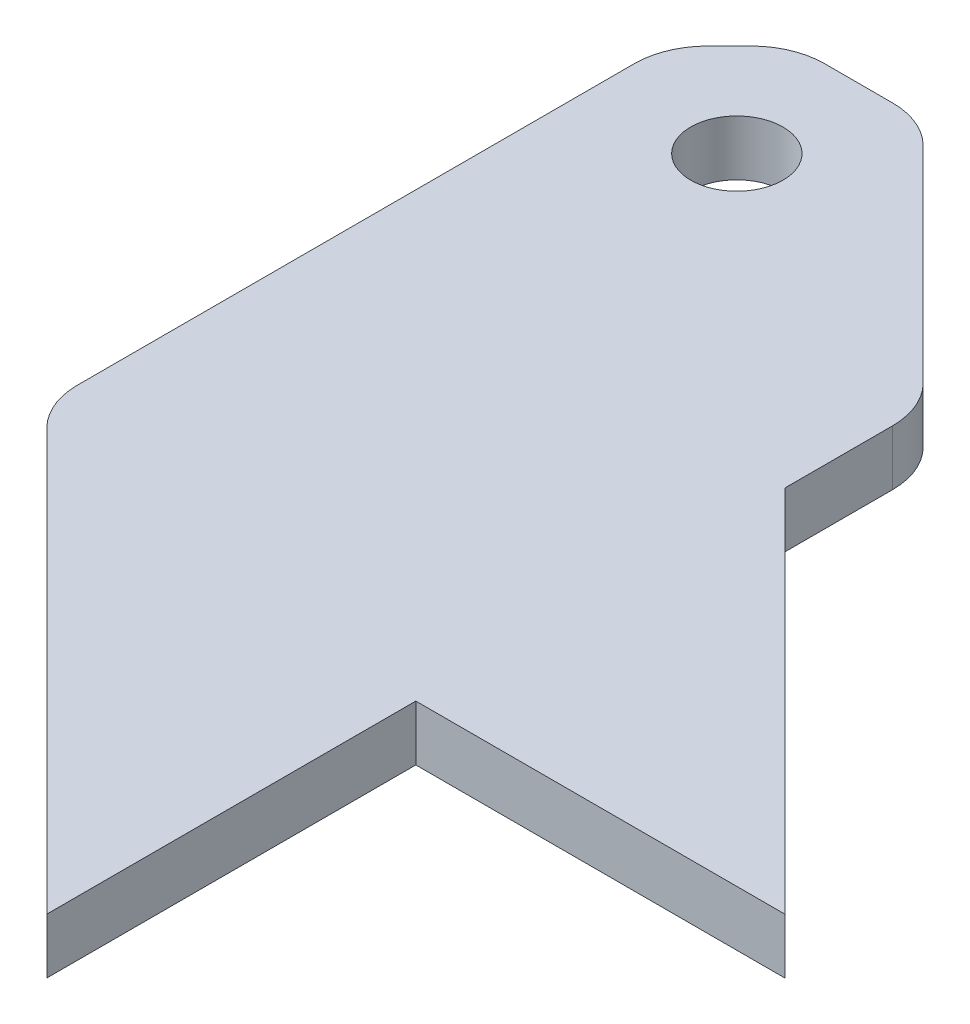
ISO-10303-21;
HEADER;
FILE_DESCRIPTION(('STEP AP214'),'2;1');
FILE_NAME('part.step','',(''),(''),'','','');
FILE_SCHEMA(('AUTOMOTIVE_DESIGN { 1 0 10303 214 1 1 1 1 }'));
ENDSEC;
DATA;
#1=APPLICATION_CONTEXT('core data for automotive mechanical design processes');
#2=APPLICATION_PROTOCOL_DEFINITION('international standard','automotive_design',2000,#1);
#3=PRODUCT_CONTEXT('',#1,'mechanical');
#4=PRODUCT('Part','Part','',(#3));
#5=PRODUCT_RELATED_PRODUCT_CATEGORY('part','',(#4));
#6=PRODUCT_DEFINITION_FORMATION('','',#4);
#7=PRODUCT_DEFINITION_CONTEXT('part definition',#1,'design');
#8=PRODUCT_DEFINITION('design','',#6,#7);
#9=PRODUCT_DEFINITION_SHAPE('','',#8);
#10=(LENGTH_UNIT() NAMED_UNIT(*) SI_UNIT(.MILLI.,.METRE.));
#11=(NAMED_UNIT(*) PLANE_ANGLE_UNIT() SI_UNIT($,.RADIAN.));
#12=(NAMED_UNIT(*) SI_UNIT($,.STERADIAN.) SOLID_ANGLE_UNIT());
#13=UNCERTAINTY_MEASURE_WITH_UNIT(LENGTH_MEASURE(1.E-05),#10,'distance_accuracy_value','');
#14=(GEOMETRIC_REPRESENTATION_CONTEXT(3) GLOBAL_UNCERTAINTY_ASSIGNED_CONTEXT((#13)) GLOBAL_UNIT_ASSIGNED_CONTEXT((#10,
#11,#12)) REPRESENTATION_CONTEXT('',''));
#15=CARTESIAN_POINT('',(0.,0.,0.));
#16=DIRECTION('',(0.,0.,1.));
#17=DIRECTION('',(1.,0.,0.));
#18=AXIS2_PLACEMENT_3D('',#15,#16,#17);
#19=CARTESIAN_POINT('',(-550.,591.,-59.9999999999939));
#20=DIRECTION('',(0.,0.,1.));
#21=DIRECTION('',(-1.,0.,0.));
#22=AXIS2_PLACEMENT_3D('',#19,#20,#21);
#23=PLANE('',#22);
#24=DIRECTION('',(0.,1.,0.));
#25=VECTOR('',#24,1.);
#26=CARTESIAN_POINT('',(-650.,591.,-59.9999999999928));
#27=LINE('',#26,#25);
#28=CARTESIAN_POINT('',(-650.,576.,-59.9999999999928));
#29=VERTEX_POINT('',#28);
#30=CARTESIAN_POINT('',(-650.,591.,-59.9999999999928));
#31=VERTEX_POINT('',#30);
#32=EDGE_CURVE('E11',#29,#31,#27,.T.);
#33=ORIENTED_EDGE('',*,*,#32,.F.);
#34=DIRECTION('',(-1.,0.,0.));
#35=VECTOR('',#34,1.);
#36=CARTESIAN_POINT('',(-649.999999999998,576.,-59.999999999995));
#37=LINE('',#36,#35);
#38=CARTESIAN_POINT('',(-550.,576.,-59.9999999999939));
#39=VERTEX_POINT('',#38);
#40=EDGE_CURVE('E122',#39,#29,#37,.T.);
#41=ORIENTED_EDGE('',*,*,#40,.F.);
#42=DIRECTION('',(0.,1.,0.));
#43=VECTOR('',#42,1.);
#44=CARTESIAN_POINT('',(-550.,591.,-59.9999999999939));
#45=LINE('',#44,#43);
#46=CARTESIAN_POINT('',(-550.,591.,-59.9999999999939));
#47=VERTEX_POINT('',#46);
#48=EDGE_CURVE('E46',#39,#47,#45,.T.);
#49=ORIENTED_EDGE('',*,*,#48,.T.);
#50=DIRECTION('',(-1.,0.,0.));
#51=VECTOR('',#50,1.);
#52=CARTESIAN_POINT('',(-550.,591.,-59.9999999999939));
#53=LINE('',#52,#51);
#54=EDGE_CURVE('E198',#47,#31,#53,.T.);
#55=ORIENTED_EDGE('',*,*,#54,.T.);
#56=EDGE_LOOP('',(#33,#41,#49,#55));
#57=FACE_BOUND('',#56,.T.);
#58=ADVANCED_FACE('F37',(#57),#23,.T.);
#59=CARTESIAN_POINT('',(-649.999999999999,591.,-159.999999999992));
#60=DIRECTION('',(-0.707106781186549,0.,0.707106781186546));
#61=DIRECTION('',(-0.707106781186537,0.,-0.70710678118654));
#62=AXIS2_PLACEMENT_3D('',#59,#60,#61);
#63=PLANE('',#62);
#64=ORIENTED_EDGE('',*,*,#48,.F.);
#65=DIRECTION('',(-0.707106781186537,0.,-0.70710678118654));
#66=VECTOR('',#65,1.);
#67=CARTESIAN_POINT('',(-649.999999999999,576.,-159.999999999992));
#68=LINE('',#67,#66);
#69=CARTESIAN_POINT('',(-650.,576.,-159.999999999993));
#70=VERTEX_POINT('',#69);
#71=EDGE_CURVE('E161',#70,#39,#68,.F.);
#72=ORIENTED_EDGE('',*,*,#71,.F.);
#73=DIRECTION('',(0.,1.,0.));
#74=VECTOR('',#73,1.);
#75=CARTESIAN_POINT('',(-650.,591.,-159.999999999993));
#76=LINE('',#75,#74);
#77=CARTESIAN_POINT('',(-650.,591.,-159.999999999993));
#78=VERTEX_POINT('',#77);
#79=EDGE_CURVE('E191',#70,#78,#76,.T.);
#80=ORIENTED_EDGE('',*,*,#79,.T.);
#81=DIRECTION('',(-0.707106781186537,0.,-0.70710678118654));
#82=VECTOR('',#81,1.);
#83=CARTESIAN_POINT('',(-649.999999999999,591.,-159.999999999992));
#84=LINE('',#83,#82);
#85=EDGE_CURVE('E208',#78,#47,#84,.F.);
#86=ORIENTED_EDGE('',*,*,#85,.T.);
#87=EDGE_LOOP('',(#64,#72,#80,#86));
#88=FACE_BOUND('',#87,.T.);
#89=ADVANCED_FACE('F211',(#88),#63,.F.);
#90=CARTESIAN_POINT('',(-649.999999999995,591.,-264.999999999993));
#91=DIRECTION('',(1.,0.,0.));
#92=DIRECTION('',(0.,0.,1.));
#93=AXIS2_PLACEMENT_3D('',#90,#91,#92);
#94=PLANE('',#93);
#95=ORIENTED_EDGE('',*,*,#79,.F.);
#96=DIRECTION('',(0.,0.,1.));
#97=VECTOR('',#96,1.);
#98=CARTESIAN_POINT('',(-649.999999999999,576.,-264.999999999993));
#99=LINE('',#98,#97);
#100=CARTESIAN_POINT('',(-650.,576.,-189.215728752532));
#101=VERTEX_POINT('',#100);
#102=EDGE_CURVE('E158',#101,#70,#99,.T.);
#103=ORIENTED_EDGE('',*,*,#102,.F.);
#104=DIRECTION('',(0.,1.,0.));
#105=VECTOR('',#104,1.);
#106=CARTESIAN_POINT('',(-650.,591.,-189.215728752532));
#107=LINE('',#106,#105);
#108=CARTESIAN_POINT('',(-650.,591.,-189.215728752532));
#109=VERTEX_POINT('',#108);
#110=EDGE_CURVE('E188',#101,#109,#107,.T.);
#111=ORIENTED_EDGE('',*,*,#110,.T.);
#112=DIRECTION('',(0.,0.,1.));
#113=VECTOR('',#112,1.);
#114=CARTESIAN_POINT('',(-649.999999999995,591.,-264.999999999993));
#115=LINE('',#114,#113);
#116=EDGE_CURVE('E212',#109,#78,#115,.T.);
#117=ORIENTED_EDGE('',*,*,#116,.T.);
#118=EDGE_LOOP('',(#95,#103,#111,#117));
#119=FACE_BOUND('',#118,.T.);
#120=ADVANCED_FACE('F268',(#119),#94,.T.);
#121=CARTESIAN_POINT('',(-670.,591.,-189.21572875253));
#122=DIRECTION('',(0.,-1.,0.));
#123=DIRECTION('',(0.,0.,-1.));
#124=AXIS2_PLACEMENT_3D('',#121,#122,#123);
#125=CYLINDRICAL_SURFACE('',#124,20.);
#126=ORIENTED_EDGE('',*,*,#110,.F.);
#127=CARTESIAN_POINT('',(-670.,576.,-189.21572875253));
#128=DIRECTION('',(0.,1.,0.));
#129=DIRECTION('',(0.,0.,1.));
#130=AXIS2_PLACEMENT_3D('',#127,#128,#129);
#131=CIRCLE('',#130,20.);
#132=CARTESIAN_POINT('',(-655.857864376265,576.,-203.357864376261));
#133=VERTEX_POINT('',#132);
#134=EDGE_CURVE('E155',#133,#101,#131,.F.);
#135=ORIENTED_EDGE('',*,*,#134,.F.);
#136=DIRECTION('',(0.,1.,0.));
#137=VECTOR('',#136,1.);
#138=CARTESIAN_POINT('',(-655.857864376265,591.,-203.357864376261));
#139=LINE('',#138,#137);
#140=CARTESIAN_POINT('',(-655.857864376265,591.,-203.357864376261));
#141=VERTEX_POINT('',#140);
#142=EDGE_CURVE('E185',#133,#141,#139,.T.);
#143=ORIENTED_EDGE('',*,*,#142,.T.);
#144=CARTESIAN_POINT('',(-670.,591.,-189.21572875253));
#145=DIRECTION('',(0.,1.,0.));
#146=DIRECTION('',(0.,0.,1.));
#147=AXIS2_PLACEMENT_3D('',#144,#145,#146);
#148=CIRCLE('',#147,20.);
#149=EDGE_CURVE('E214',#141,#109,#148,.F.);
#150=ORIENTED_EDGE('',*,*,#149,.T.);
#151=EDGE_LOOP('',(#126,#135,#143,#150));
#152=FACE_BOUND('',#151,.T.);
#153=ADVANCED_FACE('F273',(#152),#125,.T.);
#154=CARTESIAN_POINT('',(-717.499999999995,591.,-264.999999999991));
#155=DIRECTION('',(-0.707106781186548,0.,0.707106781186547));
#156=DIRECTION('',(-0.707106781186538,0.,-0.707106781186539));
#157=AXIS2_PLACEMENT_3D('',#154,#155,#156);
#158=PLANE('',#157);
#159=ORIENTED_EDGE('',*,*,#142,.F.);
#160=DIRECTION('',(-0.707106781186538,0.,-0.707106781186539));
#161=VECTOR('',#160,1.);
#162=CARTESIAN_POINT('',(-717.499999999995,576.,-264.999999999991));
#163=LINE('',#162,#161);
#164=CARTESIAN_POINT('',(-711.642135623726,576.,-259.142135623722));
#165=VERTEX_POINT('',#164);
#166=EDGE_CURVE('E152',#133,#165,#163,.T.);
#167=ORIENTED_EDGE('',*,*,#166,.T.);
#168=DIRECTION('',(0.,1.,0.));
#169=VECTOR('',#168,1.);
#170=CARTESIAN_POINT('',(-711.642135623726,591.,-259.142135623722));
#171=LINE('',#170,#169);
#172=CARTESIAN_POINT('',(-711.642135623726,591.,-259.142135623722));
#173=VERTEX_POINT('',#172);
#174=EDGE_CURVE('E182',#165,#173,#171,.T.);
#175=ORIENTED_EDGE('',*,*,#174,.T.);
#176=DIRECTION('',(-0.707106781186538,0.,-0.707106781186539));
#177=VECTOR('',#176,1.);
#178=CARTESIAN_POINT('',(-717.499999999995,591.,-264.999999999991));
#179=LINE('',#178,#177);
#180=EDGE_CURVE('E219',#141,#173,#179,.T.);
#181=ORIENTED_EDGE('',*,*,#180,.F.);
#182=EDGE_LOOP('',(#159,#167,#175,#181));
#183=FACE_BOUND('',#182,.T.);
#184=ADVANCED_FACE('F276',(#183),#158,.F.);
#185=CARTESIAN_POINT('',(-725.784271247457,591.,-244.999999999992));
#186=DIRECTION('',(0.,-1.,0.));
#187=DIRECTION('',(0.,0.,-1.));
#188=AXIS2_PLACEMENT_3D('',#185,#186,#187);
#189=CYLINDRICAL_SURFACE('',#188,20.);
#190=ORIENTED_EDGE('',*,*,#174,.F.);
#191=CARTESIAN_POINT('',(-725.784271247457,576.,-244.999999999992));
#192=DIRECTION('',(0.,1.,0.));
#193=DIRECTION('',(0.,0.,1.));
#194=AXIS2_PLACEMENT_3D('',#191,#192,#193);
#195=CIRCLE('',#194,20.);
#196=CARTESIAN_POINT('',(-725.784271247457,576.,-264.999999999991));
#197=VERTEX_POINT('',#196);
#198=EDGE_CURVE('E149',#197,#165,#195,.F.);
#199=ORIENTED_EDGE('',*,*,#198,.F.);
#200=DIRECTION('',(0.,1.,0.));
#201=VECTOR('',#200,1.);
#202=CARTESIAN_POINT('',(-725.784271247457,591.,-264.999999999991));
#203=LINE('',#202,#201);
#204=CARTESIAN_POINT('',(-725.784271247457,591.,-264.999999999991));
#205=VERTEX_POINT('',#204);
#206=EDGE_CURVE('E179',#197,#205,#203,.T.);
#207=ORIENTED_EDGE('',*,*,#206,.T.);
#208=CARTESIAN_POINT('',(-725.784271247457,591.,-244.999999999992));
#209=DIRECTION('',(0.,1.,0.));
#210=DIRECTION('',(0.,0.,1.));
#211=AXIS2_PLACEMENT_3D('',#208,#209,#210);
#212=CIRCLE('',#211,20.);
#213=EDGE_CURVE('E222',#205,#173,#212,.F.);
#214=ORIENTED_EDGE('',*,*,#213,.T.);
#215=EDGE_LOOP('',(#190,#199,#207,#214));
#216=FACE_BOUND('',#215,.T.);
#217=ADVANCED_FACE('F280',(#216),#189,.T.);
#218=CARTESIAN_POINT('',(-649.999999999995,591.,-264.999999999993));
#219=DIRECTION('',(0.,0.,1.));
#220=DIRECTION('',(-1.,0.,0.));
#221=AXIS2_PLACEMENT_3D('',#218,#219,#220);
#222=PLANE('',#221);
#223=ORIENTED_EDGE('',*,*,#206,.F.);
#224=DIRECTION('',(-1.,0.,0.));
#225=VECTOR('',#224,1.);
#226=CARTESIAN_POINT('',(-649.999999999995,576.,-264.99999999999));
#227=LINE('',#226,#225);
#228=CARTESIAN_POINT('',(-744.215728752533,576.,-264.999999999991));
#229=VERTEX_POINT('',#228);
#230=EDGE_CURVE('E146',#197,#229,#227,.T.);
#231=ORIENTED_EDGE('',*,*,#230,.T.);
#232=DIRECTION('',(0.,1.,0.));
#233=VECTOR('',#232,1.);
#234=CARTESIAN_POINT('',(-744.215728752533,591.,-264.999999999991));
#235=LINE('',#234,#233);
#236=CARTESIAN_POINT('',(-744.215728752533,591.,-264.999999999991));
#237=VERTEX_POINT('',#236);
#238=EDGE_CURVE('E176',#229,#237,#235,.T.);
#239=ORIENTED_EDGE('',*,*,#238,.T.);
#240=DIRECTION('',(-1.,0.,0.));
#241=VECTOR('',#240,1.);
#242=CARTESIAN_POINT('',(-649.999999999995,591.,-264.999999999993));
#243=LINE('',#242,#241);
#244=EDGE_CURVE('E225',#205,#237,#243,.T.);
#245=ORIENTED_EDGE('',*,*,#244,.F.);
#246=EDGE_LOOP('',(#223,#231,#239,#245));
#247=FACE_BOUND('',#246,.T.);
#248=ADVANCED_FACE('F285',(#247),#222,.F.);
#249=CARTESIAN_POINT('',(-744.215728752533,591.,-244.999999999992));
#250=DIRECTION('',(0.,-1.,0.));
#251=DIRECTION('',(0.,0.,-1.));
#252=AXIS2_PLACEMENT_3D('',#249,#250,#251);
#253=CYLINDRICAL_SURFACE('',#252,20.);
#254=ORIENTED_EDGE('',*,*,#238,.F.);
#255=CARTESIAN_POINT('',(-744.215728752533,576.,-244.999999999992));
#256=DIRECTION('',(0.,1.,0.));
#257=DIRECTION('',(0.,0.,1.));
#258=AXIS2_PLACEMENT_3D('',#255,#256,#257);
#259=CIRCLE('',#258,20.);
#260=CARTESIAN_POINT('',(-758.357864376264,576.,-259.142135623722));
#261=VERTEX_POINT('',#260);
#262=EDGE_CURVE('E143',#261,#229,#259,.F.);
#263=ORIENTED_EDGE('',*,*,#262,.F.);
#264=DIRECTION('',(0.,1.,0.));
#265=VECTOR('',#264,1.);
#266=CARTESIAN_POINT('',(-758.357864376264,591.,-259.142135623722));
#267=LINE('',#266,#265);
#268=CARTESIAN_POINT('',(-758.357864376264,591.,-259.142135623722));
#269=VERTEX_POINT('',#268);
#270=EDGE_CURVE('E173',#261,#269,#267,.T.);
#271=ORIENTED_EDGE('',*,*,#270,.T.);
#272=CARTESIAN_POINT('',(-744.215728752533,591.,-244.999999999992));
#273=DIRECTION('',(0.,1.,0.));
#274=DIRECTION('',(0.,0.,1.));
#275=AXIS2_PLACEMENT_3D('',#272,#273,#274);
#276=CIRCLE('',#275,20.);
#277=EDGE_CURVE('E228',#269,#237,#276,.F.);
#278=ORIENTED_EDGE('',*,*,#277,.T.);
#279=EDGE_LOOP('',(#254,#263,#271,#278));
#280=FACE_BOUND('',#279,.T.);
#281=ADVANCED_FACE('F288',(#280),#253,.T.);
#282=CARTESIAN_POINT('',(-769.999999999995,591.,-247.499999999991));
#283=DIRECTION('',(0.707106781186548,0.,0.707106781186548));
#284=DIRECTION('',(-0.707106781186556,0.,0.707106781186556));
#285=AXIS2_PLACEMENT_3D('',#282,#283,#284);
#286=PLANE('',#285);
#287=ORIENTED_EDGE('',*,*,#270,.F.);
#288=DIRECTION('',(-0.707106781186556,0.,0.707106781186556));
#289=VECTOR('',#288,1.);
#290=CARTESIAN_POINT('',(-769.999999999995,576.,-247.499999999991));
#291=LINE('',#290,#289);
#292=CARTESIAN_POINT('',(-764.142135623726,576.,-253.35786437626));
#293=VERTEX_POINT('',#292);
#294=EDGE_CURVE('E140',#261,#293,#291,.T.);
#295=ORIENTED_EDGE('',*,*,#294,.T.);
#296=DIRECTION('',(0.,1.,0.));
#297=VECTOR('',#296,1.);
#298=CARTESIAN_POINT('',(-764.142135623726,591.,-253.35786437626));
#299=LINE('',#298,#297);
#300=CARTESIAN_POINT('',(-764.142135623726,591.,-253.35786437626));
#301=VERTEX_POINT('',#300);
#302=EDGE_CURVE('E170',#293,#301,#299,.T.);
#303=ORIENTED_EDGE('',*,*,#302,.T.);
#304=DIRECTION('',(-0.707106781186556,0.,0.707106781186556));
#305=VECTOR('',#304,1.);
#306=CARTESIAN_POINT('',(-769.999999999995,591.,-247.499999999991));
#307=LINE('',#306,#305);
#308=EDGE_CURVE('E231',#269,#301,#307,.T.);
#309=ORIENTED_EDGE('',*,*,#308,.F.);
#310=EDGE_LOOP('',(#287,#295,#303,#309));
#311=FACE_BOUND('',#310,.T.);
#312=ADVANCED_FACE('F291',(#311),#286,.F.);
#313=CARTESIAN_POINT('',(-749.999999999995,591.,-239.21572875253));
#314=DIRECTION('',(0.,-1.,0.));
#315=DIRECTION('',(0.,0.,-1.));
#316=AXIS2_PLACEMENT_3D('',#313,#314,#315);
#317=CYLINDRICAL_SURFACE('',#316,20.);
#318=ORIENTED_EDGE('',*,*,#302,.F.);
#319=CARTESIAN_POINT('',(-749.999999999995,576.,-239.21572875253));
#320=DIRECTION('',(0.,1.,0.));
#321=DIRECTION('',(0.,0.,1.));
#322=AXIS2_PLACEMENT_3D('',#319,#320,#321);
#323=CIRCLE('',#322,20.);
#324=CARTESIAN_POINT('',(-769.999999999995,576.,-239.215728752529));
#325=VERTEX_POINT('',#324);
#326=EDGE_CURVE('E137',#325,#293,#323,.F.);
#327=ORIENTED_EDGE('',*,*,#326,.F.);
#328=DIRECTION('',(0.,1.,0.));
#329=VECTOR('',#328,1.);
#330=CARTESIAN_POINT('',(-769.999999999995,591.,-239.215728752529));
#331=LINE('',#330,#329);
#332=CARTESIAN_POINT('',(-769.999999999995,591.,-239.215728752529));
#333=VERTEX_POINT('',#332);
#334=EDGE_CURVE('E167',#325,#333,#331,.T.);
#335=ORIENTED_EDGE('',*,*,#334,.T.);
#336=CARTESIAN_POINT('',(-749.999999999995,591.,-239.21572875253));
#337=DIRECTION('',(0.,1.,0.));
#338=DIRECTION('',(0.,0.,1.));
#339=AXIS2_PLACEMENT_3D('',#336,#337,#338);
#340=CIRCLE('',#339,20.);
#341=EDGE_CURVE('E234',#333,#301,#340,.F.);
#342=ORIENTED_EDGE('',*,*,#341,.T.);
#343=EDGE_LOOP('',(#318,#327,#335,#342));
#344=FACE_BOUND('',#343,.T.);
#345=ADVANCED_FACE('F293',(#344),#317,.T.);
#346=CARTESIAN_POINT('',(-769.999999999995,591.,-264.999999999991));
#347=DIRECTION('',(1.,0.,0.));
#348=DIRECTION('',(0.,0.,1.));
#349=AXIS2_PLACEMENT_3D('',#346,#347,#348);
#350=PLANE('',#349);
#351=ORIENTED_EDGE('',*,*,#334,.F.);
#352=DIRECTION('',(0.,0.,1.));
#353=VECTOR('',#352,1.);
#354=CARTESIAN_POINT('',(-769.999999999995,576.,-264.999999999995));
#355=LINE('',#354,#353);
#356=CARTESIAN_POINT('',(-770.,576.,-88.2842712474535));
#357=VERTEX_POINT('',#356);
#358=EDGE_CURVE('E134',#325,#357,#355,.T.);
#359=ORIENTED_EDGE('',*,*,#358,.T.);
#360=DIRECTION('',(0.,1.,0.));
#361=VECTOR('',#360,1.);
#362=CARTESIAN_POINT('',(-770.,591.,-88.2842712474535));
#363=LINE('',#362,#361);
#364=CARTESIAN_POINT('',(-770.,591.,-88.2842712474535));
#365=VERTEX_POINT('',#364);
#366=EDGE_CURVE('E165',#357,#365,#363,.T.);
#367=ORIENTED_EDGE('',*,*,#366,.T.);
#368=DIRECTION('',(0.,0.,1.));
#369=VECTOR('',#368,1.);
#370=CARTESIAN_POINT('',(-769.999999999995,591.,-264.999999999991));
#371=LINE('',#370,#369);
#372=EDGE_CURVE('E237',#333,#365,#371,.T.);
#373=ORIENTED_EDGE('',*,*,#372,.F.);
#374=EDGE_LOOP('',(#351,#359,#367,#373));
#375=FACE_BOUND('',#374,.T.);
#376=ADVANCED_FACE('F245',(#375),#350,.F.);
#377=CARTESIAN_POINT('',(-750.,591.,-88.2842712474535));
#378=DIRECTION('',(0.,-1.,0.));
#379=DIRECTION('',(0.,0.,-1.));
#380=AXIS2_PLACEMENT_3D('',#377,#378,#379);
#381=CYLINDRICAL_SURFACE('',#380,20.);
#382=ORIENTED_EDGE('',*,*,#366,.F.);
#383=CARTESIAN_POINT('',(-750.,576.,-88.2842712474535));
#384=DIRECTION('',(0.,1.,0.));
#385=DIRECTION('',(0.,0.,1.));
#386=AXIS2_PLACEMENT_3D('',#383,#384,#385);
#387=CIRCLE('',#386,20.);
#388=CARTESIAN_POINT('',(-764.142135623731,576.,-74.1421356237225));
#389=VERTEX_POINT('',#388);
#390=EDGE_CURVE('E131',#389,#357,#387,.F.);
#391=ORIENTED_EDGE('',*,*,#390,.F.);
#392=DIRECTION('',(0.,1.,0.));
#393=VECTOR('',#392,1.);
#394=CARTESIAN_POINT('',(-764.142135623731,591.,-74.1421356237225));
#395=LINE('',#394,#393);
#396=CARTESIAN_POINT('',(-764.142135623731,591.,-74.1421356237225));
#397=VERTEX_POINT('',#396);
#398=EDGE_CURVE('E54',#389,#397,#395,.T.);
#399=ORIENTED_EDGE('',*,*,#398,.T.);
#400=CARTESIAN_POINT('',(-750.,591.,-88.2842712474535));
#401=DIRECTION('',(0.,1.,0.));
#402=DIRECTION('',(0.,0.,1.));
#403=AXIS2_PLACEMENT_3D('',#400,#401,#402);
#404=CIRCLE('',#403,20.);
#405=EDGE_CURVE('E115',#397,#365,#404,.F.);
#406=ORIENTED_EDGE('',*,*,#405,.T.);
#407=EDGE_LOOP('',(#382,#391,#399,#406));
#408=FACE_BOUND('',#407,.T.);
#409=ADVANCED_FACE('F240',(#408),#381,.T.);
#410=CARTESIAN_POINT('',(-770.,591.,-79.9999999999916));
#411=DIRECTION('',(-0.707106781186546,0.,0.707106781186549));
#412=DIRECTION('',(-0.70710678118654,0.,-0.707106781186537));
#413=AXIS2_PLACEMENT_3D('',#410,#411,#412);
#414=PLANE('',#413);
#415=ORIENTED_EDGE('',*,*,#398,.F.);
#416=DIRECTION('',(-0.70710678118654,0.,-0.707106781186537));
#417=VECTOR('',#416,1.);
#418=CARTESIAN_POINT('',(-770.,576.,-79.9999999999916));
#419=LINE('',#418,#417);
#420=CARTESIAN_POINT('',(-650.,576.,40.0000000000072));
#421=VERTEX_POINT('',#420);
#422=EDGE_CURVE('E120',#421,#389,#419,.T.);
#423=ORIENTED_EDGE('',*,*,#422,.F.);
#424=DIRECTION('',(0.,1.,0.));
#425=VECTOR('',#424,1.);
#426=CARTESIAN_POINT('',(-650.,591.,40.0000000000072));
#427=LINE('',#426,#425);
#428=CARTESIAN_POINT('',(-650.,591.,40.0000000000072));
#429=VERTEX_POINT('',#428);
#430=EDGE_CURVE('E40',#421,#429,#427,.T.);
#431=ORIENTED_EDGE('',*,*,#430,.T.);
#432=DIRECTION('',(-0.70710678118654,0.,-0.707106781186537));
#433=VECTOR('',#432,1.);
#434=CARTESIAN_POINT('',(-770.,591.,-79.9999999999916));
#435=LINE('',#434,#433);
#436=EDGE_CURVE('E241',#429,#397,#435,.T.);
#437=ORIENTED_EDGE('',*,*,#436,.T.);
#438=EDGE_LOOP('',(#415,#423,#431,#437));
#439=FACE_BOUND('',#438,.T.);
#440=ADVANCED_FACE('F124',(#439),#414,.T.);
#441=CARTESIAN_POINT('',(-734.999999999995,591.,-231.999999999992));
#442=DIRECTION('',(0.,-1.,0.));
#443=DIRECTION('',(0.,0.,-1.));
#444=AXIS2_PLACEMENT_3D('',#441,#442,#443);
#445=CYLINDRICAL_SURFACE('',#444,12.5);
#446=CARTESIAN_POINT('',(-734.999999999995,591.,-231.999999999992));
#447=DIRECTION('',(0.,-1.,0.));
#448=DIRECTION('',(0.,0.,-1.));
#449=AXIS2_PLACEMENT_3D('',#446,#447,#448);
#450=CIRCLE('',#449,12.5);
#451=CARTESIAN_POINT('',(-734.999999999995,591.,-244.499999999992));
#452=VERTEX_POINT('',#451);
#453=EDGE_CURVE('E133',#452,#452,#450,.T.);
#454=ORIENTED_EDGE('',*,*,#453,.F.);
#455=EDGE_LOOP('',(#454));
#456=FACE_BOUND('',#455,.T.);
#457=CARTESIAN_POINT('',(-734.999999999995,576.,-231.999999999992));
#458=DIRECTION('',(0.,-1.,0.));
#459=DIRECTION('',(0.,0.,-1.));
#460=AXIS2_PLACEMENT_3D('',#457,#458,#459);
#461=CIRCLE('',#460,12.5);
#462=CARTESIAN_POINT('',(-734.999999999995,576.,-244.499999999992));
#463=VERTEX_POINT('',#462);
#464=EDGE_CURVE('E125',#463,#463,#461,.T.);
#465=ORIENTED_EDGE('',*,*,#464,.T.);
#466=EDGE_LOOP('',(#465));
#467=FACE_BOUND('',#466,.T.);
#468=ADVANCED_FACE('F360',(#456,#467),#445,.F.);
#469=DIRECTION('',(0.,0.,1.));
#470=VECTOR('',#469,1.);
#471=CARTESIAN_POINT('',(-649.999999999997,576.,-264.999999999993));
#472=LINE('',#471,#470);
#473=EDGE_CURVE('E109',#29,#421,#472,.T.);
#474=ORIENTED_EDGE('',*,*,#473,.F.);
#475=ORIENTED_EDGE('',*,*,#32,.T.);
#476=EDGE_CURVE('E111',#31,#429,#115,.T.);
#477=ORIENTED_EDGE('',*,*,#476,.T.);
#478=ORIENTED_EDGE('',*,*,#430,.F.);
#479=EDGE_LOOP('',(#474,#475,#477,#478));
#480=FACE_BOUND('',#479,.T.);
#481=ADVANCED_FACE('F108',(#480),#94,.T.);
#482=CARTESIAN_POINT('',(-649.999999999995,591.,-264.999999999993));
#483=DIRECTION('',(0.,-1.,0.));
#484=DIRECTION('',(0.,0.,1.));
#485=AXIS2_PLACEMENT_3D('',#482,#483,#484);
#486=PLANE('',#485);
#487=ORIENTED_EDGE('',*,*,#453,.T.);
#488=EDGE_LOOP('',(#487));
#489=FACE_BOUND('',#488,.T.);
#490=ORIENTED_EDGE('',*,*,#436,.F.);
#491=ORIENTED_EDGE('',*,*,#476,.F.);
#492=ORIENTED_EDGE('',*,*,#54,.F.);
#493=ORIENTED_EDGE('',*,*,#85,.F.);
#494=ORIENTED_EDGE('',*,*,#116,.F.);
#495=ORIENTED_EDGE('',*,*,#149,.F.);
#496=ORIENTED_EDGE('',*,*,#180,.T.);
#497=ORIENTED_EDGE('',*,*,#213,.F.);
#498=ORIENTED_EDGE('',*,*,#244,.T.);
#499=ORIENTED_EDGE('',*,*,#277,.F.);
#500=ORIENTED_EDGE('',*,*,#308,.T.);
#501=ORIENTED_EDGE('',*,*,#341,.F.);
#502=ORIENTED_EDGE('',*,*,#372,.T.);
#503=ORIENTED_EDGE('',*,*,#405,.F.);
#504=EDGE_LOOP('',(#490,#491,#492,#493,#494,#495,#496,#497,#498,#499,#500,#501,#502,#503));
#505=FACE_BOUND('',#504,.T.);
#506=ADVANCED_FACE('F206',(#489,#505),#486,.F.);
#507=CARTESIAN_POINT('',(-649.999999999995,576.,-264.999999999993));
#508=DIRECTION('',(0.,-1.,0.));
#509=DIRECTION('',(0.,0.,1.));
#510=AXIS2_PLACEMENT_3D('',#507,#508,#509);
#511=PLANE('',#510);
#512=ORIENTED_EDGE('',*,*,#464,.F.);
#513=EDGE_LOOP('',(#512));
#514=FACE_BOUND('',#513,.T.);
#515=ORIENTED_EDGE('',*,*,#422,.T.);
#516=ORIENTED_EDGE('',*,*,#390,.T.);
#517=ORIENTED_EDGE('',*,*,#358,.F.);
#518=ORIENTED_EDGE('',*,*,#326,.T.);
#519=ORIENTED_EDGE('',*,*,#294,.F.);
#520=ORIENTED_EDGE('',*,*,#262,.T.);
#521=ORIENTED_EDGE('',*,*,#230,.F.);
#522=ORIENTED_EDGE('',*,*,#198,.T.);
#523=ORIENTED_EDGE('',*,*,#166,.F.);
#524=ORIENTED_EDGE('',*,*,#134,.T.);
#525=ORIENTED_EDGE('',*,*,#102,.T.);
#526=ORIENTED_EDGE('',*,*,#71,.T.);
#527=ORIENTED_EDGE('',*,*,#40,.T.);
#528=ORIENTED_EDGE('',*,*,#473,.T.);
#529=EDGE_LOOP('',(#515,#516,#517,#518,#519,#520,#521,#522,#523,#524,#525,#526,#527,#528));
#530=FACE_BOUND('',#529,.T.);
#531=ADVANCED_FACE('F118',(#514,#530),#511,.T.);
#532=CLOSED_SHELL('',(#58,#89,#120,#153,#184,#217,#248,#281,#312,#345,#376,#409,#440,#468,#481,
#506,#531));
#533=MANIFOLD_SOLID_BREP('B2',#532);
#534=ADVANCED_BREP_SHAPE_REPRESENTATION('',(#18,#533),#14);
#535=SHAPE_DEFINITION_REPRESENTATION(#9,#534);
ENDSEC;
END-ISO-10303-21;
